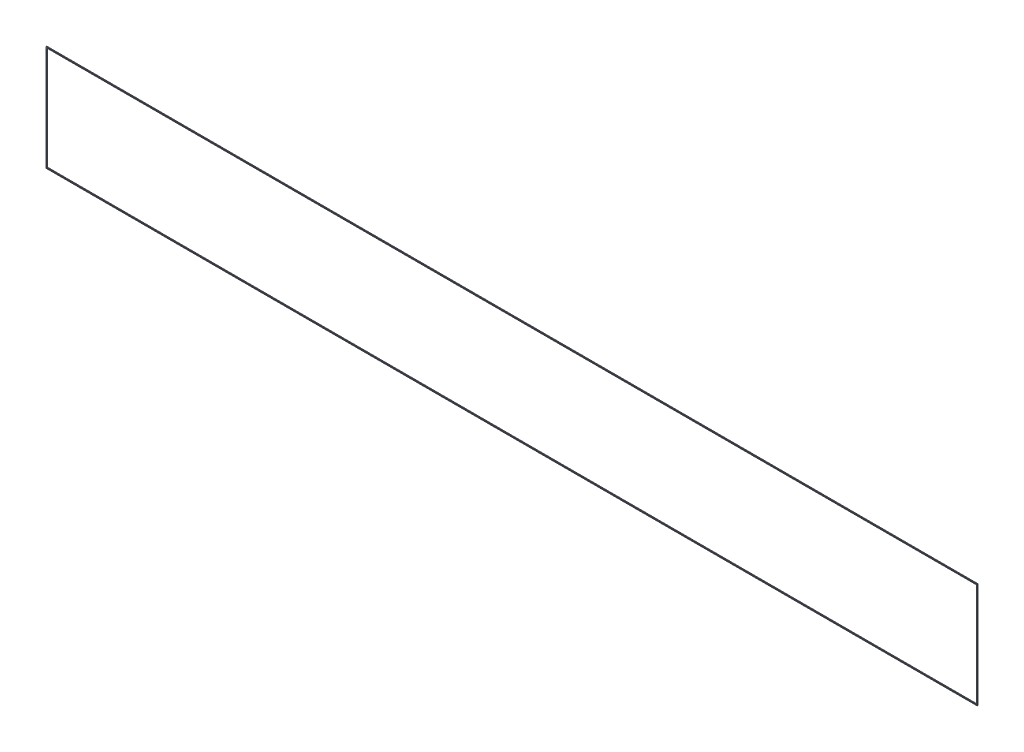
ISO-10303-21;
HEADER;
FILE_DESCRIPTION(('STEP AP214'),'2;1');
FILE_NAME('part.step','',(''),(''),'','','');
FILE_SCHEMA(('AUTOMOTIVE_DESIGN { 1 0 10303 214 1 1 1 1 }'));
ENDSEC;
DATA;
#1=APPLICATION_CONTEXT('core data for automotive mechanical design processes');
#2=APPLICATION_PROTOCOL_DEFINITION('international standard','automotive_design',2000,#1);
#3=PRODUCT_CONTEXT('',#1,'mechanical');
#4=PRODUCT('Part','Part','',(#3));
#5=PRODUCT_RELATED_PRODUCT_CATEGORY('part','',(#4));
#6=PRODUCT_DEFINITION_FORMATION('','',#4);
#7=PRODUCT_DEFINITION_CONTEXT('part definition',#1,'design');
#8=PRODUCT_DEFINITION('design','',#6,#7);
#9=PRODUCT_DEFINITION_SHAPE('','',#8);
#10=(LENGTH_UNIT() NAMED_UNIT(*) SI_UNIT(.MILLI.,.METRE.));
#11=(NAMED_UNIT(*) PLANE_ANGLE_UNIT() SI_UNIT($,.RADIAN.));
#12=(NAMED_UNIT(*) SI_UNIT($,.STERADIAN.) SOLID_ANGLE_UNIT());
#13=UNCERTAINTY_MEASURE_WITH_UNIT(LENGTH_MEASURE(1.E-05),#10,'distance_accuracy_value','');
#14=(GEOMETRIC_REPRESENTATION_CONTEXT(3) GLOBAL_UNCERTAINTY_ASSIGNED_CONTEXT((#13)) GLOBAL_UNIT_ASSIGNED_CONTEXT((#10,
#11,#12)) REPRESENTATION_CONTEXT('',''));
#15=CARTESIAN_POINT('',(0.,0.,0.));
#16=DIRECTION('',(0.,0.,1.));
#17=DIRECTION('',(1.,0.,0.));
#18=AXIS2_PLACEMENT_3D('',#15,#16,#17);
#19=CARTESIAN_POINT('',(53.067368028597,68.6995866341911,-39.));
#20=DIRECTION('',(0.,0.,-1.));
#21=DIRECTION('',(-1.,0.,0.));
#22=AXIS2_PLACEMENT_3D('',#19,#20,#21);
#23=PLANE('',#22);
#24=DIRECTION('',(1.,0.,0.));
#25=VECTOR('',#24,1.);
#26=CARTESIAN_POINT('',(160.817368028597,68.5995866341911,-39.));
#27=LINE('',#26,#25);
#28=CARTESIAN_POINT('',(53.167368028597,68.5995866341911,-39.));
#29=VERTEX_POINT('',#28);
#30=CARTESIAN_POINT('',(160.817368028597,68.5995866341911,-39.));
#31=VERTEX_POINT('',#30);
#32=EDGE_CURVE('E124',#29,#31,#27,.T.);
#33=ORIENTED_EDGE('',*,*,#32,.T.);
#34=DIRECTION('',(0.,1.,0.));
#35=VECTOR('',#34,1.);
#36=CARTESIAN_POINT('',(160.817368028597,56.5995866341911,-39.));
#37=LINE('',#36,#35);
#38=CARTESIAN_POINT('',(160.817368028597,56.5995866341911,-39.));
#39=VERTEX_POINT('',#38);
#40=EDGE_CURVE('E117',#31,#39,#37,.F.);
#41=ORIENTED_EDGE('',*,*,#40,.T.);
#42=DIRECTION('',(1.,0.,0.));
#43=VECTOR('',#42,1.);
#44=CARTESIAN_POINT('',(53.167368028597,56.5995866341911,-39.));
#45=LINE('',#44,#43);
#46=CARTESIAN_POINT('',(53.167368028597,56.5995866341911,-39.));
#47=VERTEX_POINT('',#46);
#48=EDGE_CURVE('E112',#39,#47,#45,.F.);
#49=ORIENTED_EDGE('',*,*,#48,.T.);
#50=DIRECTION('',(0.,1.,0.));
#51=VECTOR('',#50,1.);
#52=CARTESIAN_POINT('',(53.167368028597,68.5995866341911,-39.));
#53=LINE('',#52,#51);
#54=EDGE_CURVE('E108',#47,#29,#53,.T.);
#55=ORIENTED_EDGE('',*,*,#54,.T.);
#56=EDGE_LOOP('',(#33,#41,#49,#55));
#57=FACE_BOUND('',#56,.T.);
#58=DIRECTION('',(1.,0.,0.));
#59=VECTOR('',#58,1.);
#60=CARTESIAN_POINT('',(160.917368028597,56.4995866341911,-39.));
#61=LINE('',#60,#59);
#62=CARTESIAN_POINT('',(53.067368028597,56.4995866341911,-39.));
#63=VERTEX_POINT('',#62);
#64=CARTESIAN_POINT('',(160.917368028597,56.4995866341911,-39.));
#65=VERTEX_POINT('',#64);
#66=EDGE_CURVE('E106',#63,#65,#61,.T.);
#67=ORIENTED_EDGE('',*,*,#66,.T.);
#68=DIRECTION('',(0.,1.,0.));
#69=VECTOR('',#68,1.);
#70=CARTESIAN_POINT('',(160.917368028597,68.6995866341911,-39.));
#71=LINE('',#70,#69);
#72=CARTESIAN_POINT('',(160.917368028597,68.6995866341911,-39.));
#73=VERTEX_POINT('',#72);
#74=EDGE_CURVE('E92',#65,#73,#71,.T.);
#75=ORIENTED_EDGE('',*,*,#74,.T.);
#76=DIRECTION('',(1.,0.,0.));
#77=VECTOR('',#76,1.);
#78=CARTESIAN_POINT('',(53.067368028597,68.6995866341911,-39.));
#79=LINE('',#78,#77);
#80=CARTESIAN_POINT('',(53.067368028597,68.6995866341911,-39.));
#81=VERTEX_POINT('',#80);
#82=EDGE_CURVE('E79',#73,#81,#79,.F.);
#83=ORIENTED_EDGE('',*,*,#82,.T.);
#84=DIRECTION('',(0.,1.,0.));
#85=VECTOR('',#84,1.);
#86=CARTESIAN_POINT('',(53.067368028597,56.4995866341911,-39.));
#87=LINE('',#86,#85);
#88=EDGE_CURVE('E20',#81,#63,#87,.F.);
#89=ORIENTED_EDGE('',*,*,#88,.T.);
#90=EDGE_LOOP('',(#67,#75,#83,#89));
#91=FACE_BOUND('',#90,.T.);
#92=ADVANCED_FACE('F17',(#57,#91),#23,.F.);
#93=CARTESIAN_POINT('',(53.067368028597,56.4995866341911,-39.1));
#94=DIRECTION('',(1.,0.,0.));
#95=DIRECTION('',(0.,0.,-1.));
#96=AXIS2_PLACEMENT_3D('',#93,#94,#95);
#97=PLANE('',#96);
#98=DIRECTION('',(0.,0.,-1.));
#99=VECTOR('',#98,1.);
#100=CARTESIAN_POINT('',(53.067368028597,68.6995866341911,-39.1));
#101=LINE('',#100,#99);
#102=CARTESIAN_POINT('',(53.067368028597,68.6995866341911,-39.1));
#103=VERTEX_POINT('',#102);
#104=EDGE_CURVE('E85',#81,#103,#101,.T.);
#105=ORIENTED_EDGE('',*,*,#104,.T.);
#106=DIRECTION('',(0.,1.,0.));
#107=VECTOR('',#106,1.);
#108=CARTESIAN_POINT('',(53.067368028597,68.6995866341911,-39.1));
#109=LINE('',#108,#107);
#110=CARTESIAN_POINT('',(53.067368028597,56.4995866341911,-39.1));
#111=VERTEX_POINT('',#110);
#112=EDGE_CURVE('E127',#111,#103,#109,.T.);
#113=ORIENTED_EDGE('',*,*,#112,.F.);
#114=DIRECTION('',(0.,0.,1.));
#115=VECTOR('',#114,1.);
#116=CARTESIAN_POINT('',(53.067368028597,56.4995866341911,-39.1));
#117=LINE('',#116,#115);
#118=EDGE_CURVE('E88',#111,#63,#117,.T.);
#119=ORIENTED_EDGE('',*,*,#118,.T.);
#120=ORIENTED_EDGE('',*,*,#88,.F.);
#121=EDGE_LOOP('',(#105,#113,#119,#120));
#122=FACE_BOUND('',#121,.T.);
#123=ADVANCED_FACE('F84',(#122),#97,.F.);
#124=CARTESIAN_POINT('',(53.067368028597,68.6995866341911,-39.1));
#125=DIRECTION('',(0.,-1.,0.));
#126=DIRECTION('',(0.,0.,-1.));
#127=AXIS2_PLACEMENT_3D('',#124,#125,#126);
#128=PLANE('',#127);
#129=DIRECTION('',(0.,0.,1.));
#130=VECTOR('',#129,1.);
#131=CARTESIAN_POINT('',(160.917368028597,68.6995866341911,-39.1));
#132=LINE('',#131,#130);
#133=CARTESIAN_POINT('',(160.917368028597,68.6995866341911,-39.1));
#134=VERTEX_POINT('',#133);
#135=EDGE_CURVE('E94',#73,#134,#132,.F.);
#136=ORIENTED_EDGE('',*,*,#135,.T.);
#137=DIRECTION('',(-1.,0.,0.));
#138=VECTOR('',#137,1.);
#139=CARTESIAN_POINT('',(53.067368028597,68.6995866341911,-39.1));
#140=LINE('',#139,#138);
#141=EDGE_CURVE('E98',#103,#134,#140,.F.);
#142=ORIENTED_EDGE('',*,*,#141,.F.);
#143=ORIENTED_EDGE('',*,*,#104,.F.);
#144=ORIENTED_EDGE('',*,*,#82,.F.);
#145=EDGE_LOOP('',(#136,#142,#143,#144));
#146=FACE_BOUND('',#145,.T.);
#147=ADVANCED_FACE('F96',(#146),#128,.F.);
#148=CARTESIAN_POINT('',(160.917368028597,68.6995866341911,-39.1));
#149=DIRECTION('',(-1.,0.,0.));
#150=DIRECTION('',(0.,0.,1.));
#151=AXIS2_PLACEMENT_3D('',#148,#149,#150);
#152=PLANE('',#151);
#153=DIRECTION('',(0.,0.,1.));
#154=VECTOR('',#153,1.);
#155=CARTESIAN_POINT('',(160.917368028597,56.4995866341911,-39.1));
#156=LINE('',#155,#154);
#157=CARTESIAN_POINT('',(160.917368028597,56.4995866341911,-39.1));
#158=VERTEX_POINT('',#157);
#159=EDGE_CURVE('E103',#65,#158,#156,.F.);
#160=ORIENTED_EDGE('',*,*,#159,.T.);
#161=DIRECTION('',(0.,1.,0.));
#162=VECTOR('',#161,1.);
#163=CARTESIAN_POINT('',(160.917368028597,68.6995866341911,-39.1));
#164=LINE('',#163,#162);
#165=EDGE_CURVE('E130',#134,#158,#164,.F.);
#166=ORIENTED_EDGE('',*,*,#165,.F.);
#167=ORIENTED_EDGE('',*,*,#135,.F.);
#168=ORIENTED_EDGE('',*,*,#74,.F.);
#169=EDGE_LOOP('',(#160,#166,#167,#168));
#170=FACE_BOUND('',#169,.T.);
#171=ADVANCED_FACE('F168',(#170),#152,.F.);
#172=CARTESIAN_POINT('',(160.917368028597,56.4995866341911,-39.1));
#173=DIRECTION('',(0.,1.,0.));
#174=DIRECTION('',(0.,0.,1.));
#175=AXIS2_PLACEMENT_3D('',#172,#173,#174);
#176=PLANE('',#175);
#177=ORIENTED_EDGE('',*,*,#118,.F.);
#178=DIRECTION('',(-1.,0.,0.));
#179=VECTOR('',#178,1.);
#180=CARTESIAN_POINT('',(53.067368028597,56.4995866341911,-39.1));
#181=LINE('',#180,#179);
#182=EDGE_CURVE('E133',#158,#111,#181,.T.);
#183=ORIENTED_EDGE('',*,*,#182,.F.);
#184=ORIENTED_EDGE('',*,*,#159,.F.);
#185=ORIENTED_EDGE('',*,*,#66,.F.);
#186=EDGE_LOOP('',(#177,#183,#184,#185));
#187=FACE_BOUND('',#186,.T.);
#188=ADVANCED_FACE('F160',(#187),#176,.F.);
#189=CARTESIAN_POINT('',(53.167368028597,68.5995866341911,-39.1));
#190=DIRECTION('',(-1.,0.,0.));
#191=DIRECTION('',(0.,0.,1.));
#192=AXIS2_PLACEMENT_3D('',#189,#190,#191);
#193=PLANE('',#192);
#194=DIRECTION('',(0.,0.,-1.));
#195=VECTOR('',#194,1.);
#196=CARTESIAN_POINT('',(53.167368028597,56.5995866341911,-39.1));
#197=LINE('',#196,#195);
#198=CARTESIAN_POINT('',(53.167368028597,56.5995866341911,-39.1));
#199=VERTEX_POINT('',#198);
#200=EDGE_CURVE('E110',#47,#199,#197,.T.);
#201=ORIENTED_EDGE('',*,*,#200,.T.);
#202=DIRECTION('',(0.,1.,0.));
#203=VECTOR('',#202,1.);
#204=CARTESIAN_POINT('',(53.167368028597,68.6995866341911,-39.1));
#205=LINE('',#204,#203);
#206=CARTESIAN_POINT('',(53.167368028597,68.5995866341911,-39.1));
#207=VERTEX_POINT('',#206);
#208=EDGE_CURVE('E136',#207,#199,#205,.F.);
#209=ORIENTED_EDGE('',*,*,#208,.F.);
#210=DIRECTION('',(0.,0.,1.));
#211=VECTOR('',#210,1.);
#212=CARTESIAN_POINT('',(53.167368028597,68.5995866341911,-39.1));
#213=LINE('',#212,#211);
#214=EDGE_CURVE('E121',#207,#29,#213,.T.);
#215=ORIENTED_EDGE('',*,*,#214,.T.);
#216=ORIENTED_EDGE('',*,*,#54,.F.);
#217=EDGE_LOOP('',(#201,#209,#215,#216));
#218=FACE_BOUND('',#217,.T.);
#219=ADVANCED_FACE('F158',(#218),#193,.F.);
#220=CARTESIAN_POINT('',(53.167368028597,56.5995866341911,-39.1));
#221=DIRECTION('',(0.,-1.,0.));
#222=DIRECTION('',(0.,0.,-1.));
#223=AXIS2_PLACEMENT_3D('',#220,#221,#222);
#224=PLANE('',#223);
#225=DIRECTION('',(0.,0.,-1.));
#226=VECTOR('',#225,1.);
#227=CARTESIAN_POINT('',(160.817368028597,56.5995866341911,-39.1));
#228=LINE('',#227,#226);
#229=CARTESIAN_POINT('',(160.817368028597,56.5995866341911,-39.1));
#230=VERTEX_POINT('',#229);
#231=EDGE_CURVE('E115',#39,#230,#228,.T.);
#232=ORIENTED_EDGE('',*,*,#231,.T.);
#233=DIRECTION('',(-1.,0.,0.));
#234=VECTOR('',#233,1.);
#235=CARTESIAN_POINT('',(53.067368028597,56.5995866341911,-39.1));
#236=LINE('',#235,#234);
#237=EDGE_CURVE('E139',#199,#230,#236,.F.);
#238=ORIENTED_EDGE('',*,*,#237,.F.);
#239=ORIENTED_EDGE('',*,*,#200,.F.);
#240=ORIENTED_EDGE('',*,*,#48,.F.);
#241=EDGE_LOOP('',(#232,#238,#239,#240));
#242=FACE_BOUND('',#241,.T.);
#243=ADVANCED_FACE('F150',(#242),#224,.F.);
#244=CARTESIAN_POINT('',(160.817368028597,56.5995866341911,-39.1));
#245=DIRECTION('',(1.,0.,0.));
#246=DIRECTION('',(0.,0.,-1.));
#247=AXIS2_PLACEMENT_3D('',#244,#245,#246);
#248=PLANE('',#247);
#249=DIRECTION('',(0.,0.,1.));
#250=VECTOR('',#249,1.);
#251=CARTESIAN_POINT('',(160.817368028597,68.5995866341911,-39.1));
#252=LINE('',#251,#250);
#253=CARTESIAN_POINT('',(160.817368028597,68.5995866341911,-39.1));
#254=VERTEX_POINT('',#253);
#255=EDGE_CURVE('E35',#31,#254,#252,.F.);
#256=ORIENTED_EDGE('',*,*,#255,.T.);
#257=DIRECTION('',(0.,1.,0.));
#258=VECTOR('',#257,1.);
#259=CARTESIAN_POINT('',(160.817368028597,68.6995866341911,-39.1));
#260=LINE('',#259,#258);
#261=EDGE_CURVE('E26',#230,#254,#260,.T.);
#262=ORIENTED_EDGE('',*,*,#261,.F.);
#263=ORIENTED_EDGE('',*,*,#231,.F.);
#264=ORIENTED_EDGE('',*,*,#40,.F.);
#265=EDGE_LOOP('',(#256,#262,#263,#264));
#266=FACE_BOUND('',#265,.T.);
#267=ADVANCED_FACE('F148',(#266),#248,.F.);
#268=CARTESIAN_POINT('',(160.817368028597,68.5995866341911,-39.1));
#269=DIRECTION('',(0.,1.,0.));
#270=DIRECTION('',(0.,0.,1.));
#271=AXIS2_PLACEMENT_3D('',#268,#269,#270);
#272=PLANE('',#271);
#273=ORIENTED_EDGE('',*,*,#214,.F.);
#274=DIRECTION('',(-1.,0.,0.));
#275=VECTOR('',#274,1.);
#276=CARTESIAN_POINT('',(53.067368028597,68.5995866341911,-39.1));
#277=LINE('',#276,#275);
#278=EDGE_CURVE('E11',#254,#207,#277,.T.);
#279=ORIENTED_EDGE('',*,*,#278,.F.);
#280=ORIENTED_EDGE('',*,*,#255,.F.);
#281=ORIENTED_EDGE('',*,*,#32,.F.);
#282=EDGE_LOOP('',(#273,#279,#280,#281));
#283=FACE_BOUND('',#282,.T.);
#284=ADVANCED_FACE('F156',(#283),#272,.F.);
#285=CARTESIAN_POINT('',(53.067368028597,68.6995866341911,-39.1));
#286=DIRECTION('',(0.,0.,-1.));
#287=DIRECTION('',(-1.,0.,0.));
#288=AXIS2_PLACEMENT_3D('',#285,#286,#287);
#289=PLANE('',#288);
#290=ORIENTED_EDGE('',*,*,#261,.T.);
#291=ORIENTED_EDGE('',*,*,#278,.T.);
#292=ORIENTED_EDGE('',*,*,#208,.T.);
#293=ORIENTED_EDGE('',*,*,#237,.T.);
#294=EDGE_LOOP('',(#290,#291,#292,#293));
#295=FACE_BOUND('',#294,.T.);
#296=ORIENTED_EDGE('',*,*,#165,.T.);
#297=ORIENTED_EDGE('',*,*,#182,.T.);
#298=ORIENTED_EDGE('',*,*,#112,.T.);
#299=ORIENTED_EDGE('',*,*,#141,.T.);
#300=EDGE_LOOP('',(#296,#297,#298,#299));
#301=FACE_BOUND('',#300,.T.);
#302=ADVANCED_FACE('F144',(#295,#301),#289,.T.);
#303=CLOSED_SHELL('',(#92,#123,#147,#171,#188,#219,#243,#267,#284,#302));
#304=MANIFOLD_SOLID_BREP('B1',#303);
#305=ADVANCED_BREP_SHAPE_REPRESENTATION('',(#18,#304),#14);
#306=SHAPE_DEFINITION_REPRESENTATION(#9,#305);
ENDSEC;
END-ISO-10303-21;
